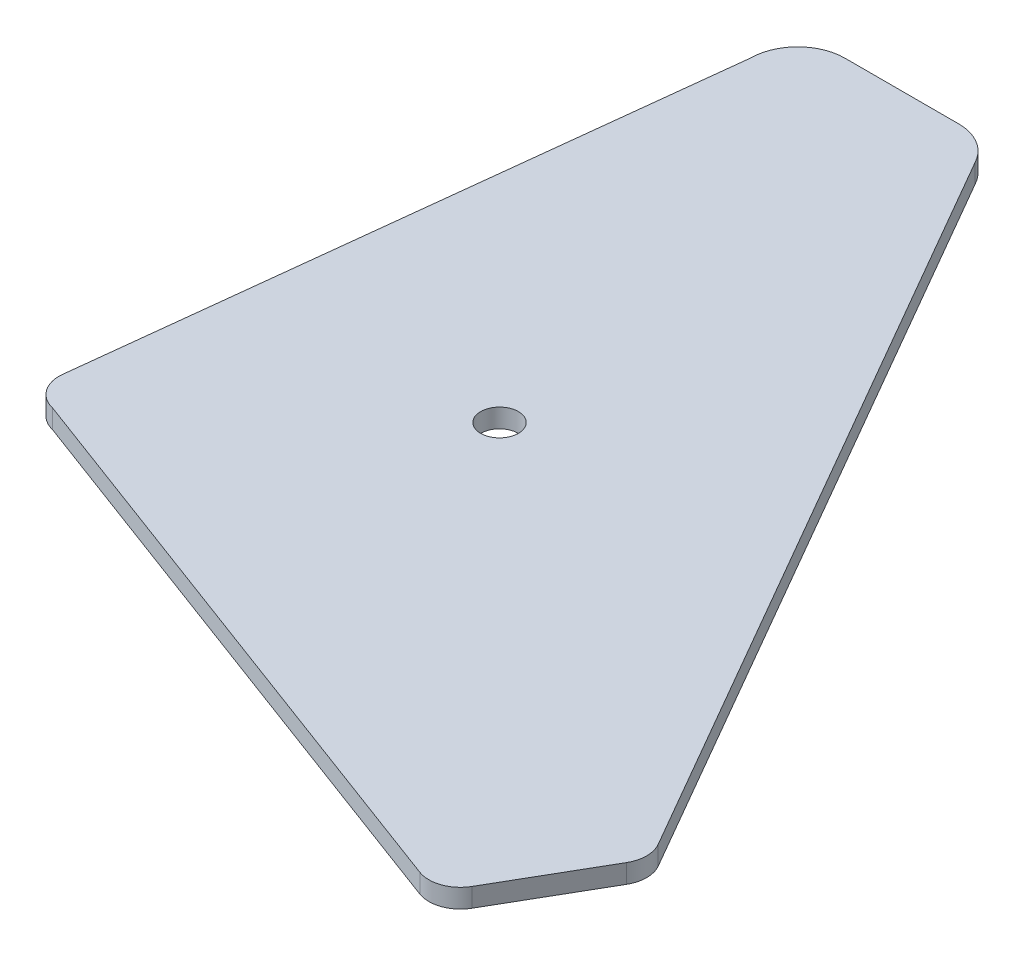
ISO-10303-21;
HEADER;
FILE_DESCRIPTION(('STEP AP214'),'2;1');
FILE_NAME('part.step','',(''),(''),'','','');
FILE_SCHEMA(('AUTOMOTIVE_DESIGN { 1 0 10303 214 1 1 1 1 }'));
ENDSEC;
DATA;
#1=APPLICATION_CONTEXT('core data for automotive mechanical design processes');
#2=APPLICATION_PROTOCOL_DEFINITION('international standard','automotive_design',2000,#1);
#3=PRODUCT_CONTEXT('',#1,'mechanical');
#4=PRODUCT('Part','Part','',(#3));
#5=PRODUCT_RELATED_PRODUCT_CATEGORY('part','',(#4));
#6=PRODUCT_DEFINITION_FORMATION('','',#4);
#7=PRODUCT_DEFINITION_CONTEXT('part definition',#1,'design');
#8=PRODUCT_DEFINITION('design','',#6,#7);
#9=PRODUCT_DEFINITION_SHAPE('','',#8);
#10=(LENGTH_UNIT() NAMED_UNIT(*) SI_UNIT(.MILLI.,.METRE.));
#11=(NAMED_UNIT(*) PLANE_ANGLE_UNIT() SI_UNIT($,.RADIAN.));
#12=(NAMED_UNIT(*) SI_UNIT($,.STERADIAN.) SOLID_ANGLE_UNIT());
#13=UNCERTAINTY_MEASURE_WITH_UNIT(LENGTH_MEASURE(1.E-05),#10,'distance_accuracy_value','');
#14=(GEOMETRIC_REPRESENTATION_CONTEXT(3) GLOBAL_UNCERTAINTY_ASSIGNED_CONTEXT((#13)) GLOBAL_UNIT_ASSIGNED_CONTEXT((#10,
#11,#12)) REPRESENTATION_CONTEXT('',''));
#15=CARTESIAN_POINT('',(0.,0.,0.));
#16=DIRECTION('',(0.,0.,1.));
#17=DIRECTION('',(1.,0.,0.));
#18=AXIS2_PLACEMENT_3D('',#15,#16,#17);
#19=CARTESIAN_POINT('',(596.941268489022,-6.,-523.011960660028));
#20=DIRECTION('',(0.,-1.,0.));
#21=DIRECTION('',(0.,0.,-1.));
#22=AXIS2_PLACEMENT_3D('',#19,#20,#21);
#23=PLANE('',#22);
#24=CARTESIAN_POINT('',(596.941268489022,-6.,-523.011960660028));
#25=DIRECTION('',(0.,-1.,0.));
#26=DIRECTION('',(0.,0.,-1.));
#27=AXIS2_PLACEMENT_3D('',#24,#25,#26);
#28=CIRCLE('',#27,15.);
#29=CARTESIAN_POINT('',(581.941268489022,-6.,-523.011960660028));
#30=VERTEX_POINT('',#29);
#31=CARTESIAN_POINT('',(596.941268489022,-6.,-538.011960660028));
#32=VERTEX_POINT('',#31);
#33=EDGE_CURVE('E125',#30,#32,#28,.T.);
#34=ORIENTED_EDGE('',*,*,#33,.T.);
#35=DIRECTION('',(-0.999999946599628,0.,-0.000326803827680212));
#36=VECTOR('',#35,1.);
#37=CARTESIAN_POINT('',(633.540164760071,-6.,-537.999999999999));
#38=LINE('',#37,#36);
#39=CARTESIAN_POINT('',(633.540164760071,-6.,-537.999999999999));
#40=VERTEX_POINT('',#39);
#41=EDGE_CURVE('E231',#40,#32,#38,.T.);
#42=ORIENTED_EDGE('',*,*,#41,.F.);
#43=CARTESIAN_POINT('',(633.051965401598,-6.,-523.007946725468));
#44=DIRECTION('',(0.,1.,0.));
#45=DIRECTION('',(0.,0.,1.));
#46=AXIS2_PLACEMENT_3D('',#43,#44,#45);
#47=CIRCLE('',#46,15.0000000000004);
#48=CARTESIAN_POINT('',(646.316882655115,-6.,-530.010943959323));
#49=VERTEX_POINT('',#48);
#50=EDGE_CURVE('E216',#49,#40,#47,.T.);
#51=ORIENTED_EDGE('',*,*,#50,.F.);
#52=DIRECTION('',(-0.499716952882985,0.,-0.866188759452202));
#53=VECTOR('',#52,1.);
#54=CARTESIAN_POINT('',(783.577542100858,-6.,-292.088977051909));
#55=LINE('',#54,#53);
#56=CARTESIAN_POINT('',(783.577542100858,-6.,-292.088977051909));
#57=VERTEX_POINT('',#56);
#58=EDGE_CURVE('E230',#57,#49,#55,.T.);
#59=ORIENTED_EDGE('',*,*,#58,.F.);
#60=CARTESIAN_POINT('',(774.915654506336,-6.,-287.091807523079));
#61=DIRECTION('',(0.,-1.,0.));
#62=DIRECTION('',(0.,0.,-1.));
#63=AXIS2_PLACEMENT_3D('',#60,#61,#62);
#64=CIRCLE('',#63,9.99999999999997);
#65=CARTESIAN_POINT('',(783.574274062581,-6.,-282.088977585913));
#66=VERTEX_POINT('',#65);
#67=EDGE_CURVE('E233',#57,#66,#64,.T.);
#68=ORIENTED_EDGE('',*,*,#67,.T.);
#69=DIRECTION('',(0.500282993716643,0.,-0.865861955624517));
#70=VECTOR('',#69,1.);
#71=CARTESIAN_POINT('',(765.564086288782,-6.,-250.91794718343));
#72=LINE('',#71,#70);
#73=CARTESIAN_POINT('',(765.564086288782,-6.,-250.91794718343));
#74=VERTEX_POINT('',#73);
#75=EDGE_CURVE('E239',#74,#66,#72,.T.);
#76=ORIENTED_EDGE('',*,*,#75,.F.);
#77=CARTESIAN_POINT('',(756.905466732537,-6.,-255.920777120597));
#78=DIRECTION('',(0.,-1.,0.));
#79=DIRECTION('',(0.,0.,-1.));
#80=AXIS2_PLACEMENT_3D('',#77,#78,#79);
#81=CIRCLE('',#80,9.99999999999988);
#82=CARTESIAN_POINT('',(753.410404170085,-6.,-246.551436819138));
#83=VERTEX_POINT('',#82);
#84=EDGE_CURVE('E154',#74,#83,#81,.T.);
#85=ORIENTED_EDGE('',*,*,#84,.T.);
#86=DIRECTION('',(-0.936934030145917,0.,-0.349506256245191));
#87=VECTOR('',#86,1.);
#88=CARTESIAN_POINT('',(753.410404170085,-6.,-246.551436819138));
#89=LINE('',#88,#87);
#90=CARTESIAN_POINT('',(567.332363615802,-6.,-315.964476831613));
#91=VERTEX_POINT('',#90);
#92=EDGE_CURVE('E147',#83,#91,#89,.T.);
#93=ORIENTED_EDGE('',*,*,#92,.T.);
#94=CARTESIAN_POINT('',(569.645526750389,-6.,-325.693262794557));
#95=DIRECTION('',(0.,1.,0.));
#96=DIRECTION('',(0.,0.,1.));
#97=AXIS2_PLACEMENT_3D('',#94,#95,#96);
#98=CIRCLE('',#97,9.99999999999998);
#99=CARTESIAN_POINT('',(559.709119695535,-6.,-326.819235636259));
#100=VERTEX_POINT('',#99);
#101=EDGE_CURVE('E151',#100,#91,#98,.T.);
#102=ORIENTED_EDGE('',*,*,#101,.F.);
#103=DIRECTION('',(-0.112597284170146,0.,0.993640705485392));
#104=VECTOR('',#103,1.);
#105=CARTESIAN_POINT('',(581.941268489022,-6.,-523.011960660028));
#106=LINE('',#105,#104);
#107=EDGE_CURVE('E169',#30,#100,#106,.T.);
#108=ORIENTED_EDGE('',*,*,#107,.F.);
#109=EDGE_LOOP('',(#34,#42,#51,#59,#68,#76,#85,#93,#102,#108));
#110=FACE_BOUND('',#109,.T.);
#111=CARTESIAN_POINT('',(642.330973066397,-6.,-382.939920306047));
#112=DIRECTION('',(0.,-1.,0.));
#113=DIRECTION('',(0.,0.,-1.));
#114=AXIS2_PLACEMENT_3D('',#111,#112,#113);
#115=CIRCLE('',#114,5.99999999999999);
#116=CARTESIAN_POINT('',(642.330973066397,-6.,-388.939920306047));
#117=VERTEX_POINT('',#116);
#118=EDGE_CURVE('E177',#117,#117,#115,.T.);
#119=ORIENTED_EDGE('',*,*,#118,.F.);
#120=EDGE_LOOP('',(#119));
#121=FACE_BOUND('',#120,.T.);
#122=ADVANCED_FACE('F65',(#110,#121),#23,.T.);
#123=CARTESIAN_POINT('',(596.941268489022,0.,-523.011960660028));
#124=DIRECTION('',(0.,-1.,0.));
#125=DIRECTION('',(0.,0.,-1.));
#126=AXIS2_PLACEMENT_3D('',#123,#124,#125);
#127=PLANE('',#126);
#128=CARTESIAN_POINT('',(596.941268489022,0.,-523.011960660028));
#129=DIRECTION('',(0.,-1.,0.));
#130=DIRECTION('',(0.,0.,-1.));
#131=AXIS2_PLACEMENT_3D('',#128,#129,#130);
#132=CIRCLE('',#131,15.);
#133=CARTESIAN_POINT('',(581.941268489022,0.,-523.011960660028));
#134=VERTEX_POINT('',#133);
#135=CARTESIAN_POINT('',(596.941268489022,0.,-538.011960660028));
#136=VERTEX_POINT('',#135);
#137=EDGE_CURVE('E174',#134,#136,#132,.T.);
#138=ORIENTED_EDGE('',*,*,#137,.F.);
#139=DIRECTION('',(-0.112597284170146,0.,0.993640705485392));
#140=VECTOR('',#139,1.);
#141=CARTESIAN_POINT('',(581.941268489022,0.,-523.011960660028));
#142=LINE('',#141,#140);
#143=CARTESIAN_POINT('',(559.709119695535,0.,-326.819235636259));
#144=VERTEX_POINT('',#143);
#145=EDGE_CURVE('E197',#134,#144,#142,.T.);
#146=ORIENTED_EDGE('',*,*,#145,.T.);
#147=CARTESIAN_POINT('',(569.645526750389,0.,-325.693262794557));
#148=DIRECTION('',(0.,1.,0.));
#149=DIRECTION('',(0.,0.,1.));
#150=AXIS2_PLACEMENT_3D('',#147,#148,#149);
#151=CIRCLE('',#150,9.99999999999998);
#152=CARTESIAN_POINT('',(567.332363615802,0.,-315.964476831613));
#153=VERTEX_POINT('',#152);
#154=EDGE_CURVE('E195',#144,#153,#151,.T.);
#155=ORIENTED_EDGE('',*,*,#154,.T.);
#156=DIRECTION('',(-0.936934030145917,0.,-0.349506256245191));
#157=VECTOR('',#156,1.);
#158=CARTESIAN_POINT('',(753.410404170085,0.,-246.551436819138));
#159=LINE('',#158,#157);
#160=CARTESIAN_POINT('',(753.410404170085,0.,-246.551436819138));
#161=VERTEX_POINT('',#160);
#162=EDGE_CURVE('E163',#161,#153,#159,.T.);
#163=ORIENTED_EDGE('',*,*,#162,.F.);
#164=CARTESIAN_POINT('',(756.905466732537,0.,-255.920777120597));
#165=DIRECTION('',(0.,-1.,0.));
#166=DIRECTION('',(0.,0.,-1.));
#167=AXIS2_PLACEMENT_3D('',#164,#165,#166);
#168=CIRCLE('',#167,9.99999999999988);
#169=CARTESIAN_POINT('',(765.564086288782,0.,-250.91794718343));
#170=VERTEX_POINT('',#169);
#171=EDGE_CURVE('E192',#170,#161,#168,.T.);
#172=ORIENTED_EDGE('',*,*,#171,.F.);
#173=DIRECTION('',(0.500282993716643,0.,-0.865861955624517));
#174=VECTOR('',#173,1.);
#175=CARTESIAN_POINT('',(765.564086288782,0.,-250.91794718343));
#176=LINE('',#175,#174);
#177=CARTESIAN_POINT('',(783.574274062581,0.,-282.088977585913));
#178=VERTEX_POINT('',#177);
#179=EDGE_CURVE('E189',#170,#178,#176,.T.);
#180=ORIENTED_EDGE('',*,*,#179,.T.);
#181=CARTESIAN_POINT('',(774.915654506336,0.,-287.091807523079));
#182=DIRECTION('',(0.,-1.,0.));
#183=DIRECTION('',(0.,0.,-1.));
#184=AXIS2_PLACEMENT_3D('',#181,#182,#183);
#185=CIRCLE('',#184,9.99999999999997);
#186=CARTESIAN_POINT('',(783.577542100858,0.,-292.088977051909));
#187=VERTEX_POINT('',#186);
#188=EDGE_CURVE('E186',#187,#178,#185,.T.);
#189=ORIENTED_EDGE('',*,*,#188,.F.);
#190=DIRECTION('',(-0.499716952882985,0.,-0.866188759452202));
#191=VECTOR('',#190,1.);
#192=CARTESIAN_POINT('',(783.577542100858,0.,-292.088977051909));
#193=LINE('',#192,#191);
#194=CARTESIAN_POINT('',(646.316882655115,0.,-530.010943959323));
#195=VERTEX_POINT('',#194);
#196=EDGE_CURVE('E183',#187,#195,#193,.T.);
#197=ORIENTED_EDGE('',*,*,#196,.T.);
#198=CARTESIAN_POINT('',(633.051965401598,0.,-523.007946725468));
#199=DIRECTION('',(0.,1.,0.));
#200=DIRECTION('',(0.,0.,1.));
#201=AXIS2_PLACEMENT_3D('',#198,#199,#200);
#202=CIRCLE('',#201,15.0000000000004);
#203=CARTESIAN_POINT('',(633.540164760071,0.,-537.999999999999));
#204=VERTEX_POINT('',#203);
#205=EDGE_CURVE('E180',#195,#204,#202,.T.);
#206=ORIENTED_EDGE('',*,*,#205,.T.);
#207=DIRECTION('',(-0.999999946599628,0.,-0.000326803827680212));
#208=VECTOR('',#207,1.);
#209=CARTESIAN_POINT('',(633.540164760071,0.,-537.999999999999));
#210=LINE('',#209,#208);
#211=EDGE_CURVE('E176',#204,#136,#210,.T.);
#212=ORIENTED_EDGE('',*,*,#211,.T.);
#213=EDGE_LOOP('',(#138,#146,#155,#163,#172,#180,#189,#197,#206,#212));
#214=FACE_BOUND('',#213,.T.);
#215=CARTESIAN_POINT('',(642.330973066397,0.,-382.939920306047));
#216=DIRECTION('',(0.,-1.,0.));
#217=DIRECTION('',(0.,0.,-1.));
#218=AXIS2_PLACEMENT_3D('',#215,#216,#217);
#219=CIRCLE('',#218,5.99999999999999);
#220=CARTESIAN_POINT('',(642.330973066397,0.,-388.939920306047));
#221=VERTEX_POINT('',#220);
#222=EDGE_CURVE('E356',#221,#221,#219,.T.);
#223=ORIENTED_EDGE('',*,*,#222,.T.);
#224=EDGE_LOOP('',(#223));
#225=FACE_BOUND('',#224,.T.);
#226=ADVANCED_FACE('F221',(#214,#225),#127,.F.);
#227=CARTESIAN_POINT('',(596.941268489022,-6.,-523.011960660028));
#228=DIRECTION('',(0.,1.,0.));
#229=DIRECTION('',(0.,0.,1.));
#230=AXIS2_PLACEMENT_3D('',#227,#228,#229);
#231=CYLINDRICAL_SURFACE('',#230,15.);
#232=ORIENTED_EDGE('',*,*,#137,.T.);
#233=DIRECTION('',(0.,1.,0.));
#234=VECTOR('',#233,1.);
#235=CARTESIAN_POINT('',(596.941268489022,-6.,-538.011960660028));
#236=LINE('',#235,#234);
#237=EDGE_CURVE('E12',#32,#136,#236,.T.);
#238=ORIENTED_EDGE('',*,*,#237,.F.);
#239=ORIENTED_EDGE('',*,*,#33,.F.);
#240=DIRECTION('',(0.,1.,0.));
#241=VECTOR('',#240,1.);
#242=CARTESIAN_POINT('',(581.941268489022,-6.,-523.011960660028));
#243=LINE('',#242,#241);
#244=EDGE_CURVE('E82',#30,#134,#243,.T.);
#245=ORIENTED_EDGE('',*,*,#244,.T.);
#246=EDGE_LOOP('',(#232,#238,#239,#245));
#247=FACE_BOUND('',#246,.T.);
#248=ADVANCED_FACE('F67',(#247),#231,.T.);
#249=CARTESIAN_POINT('',(633.540164760071,-6.,-537.999999999999));
#250=DIRECTION('',(0.000326803827680212,0.,-0.999999946599628));
#251=DIRECTION('',(-0.999999946599628,0.,-0.000326803827680212));
#252=AXIS2_PLACEMENT_3D('',#249,#250,#251);
#253=PLANE('',#252);
#254=ORIENTED_EDGE('',*,*,#211,.F.);
#255=DIRECTION('',(0.,1.,0.));
#256=VECTOR('',#255,1.);
#257=CARTESIAN_POINT('',(633.540164760071,-6.,-537.999999999999));
#258=LINE('',#257,#256);
#259=EDGE_CURVE('E74',#40,#204,#258,.T.);
#260=ORIENTED_EDGE('',*,*,#259,.F.);
#261=ORIENTED_EDGE('',*,*,#41,.T.);
#262=ORIENTED_EDGE('',*,*,#237,.T.);
#263=EDGE_LOOP('',(#254,#260,#261,#262));
#264=FACE_BOUND('',#263,.T.);
#265=ADVANCED_FACE('F219',(#264),#253,.T.);
#266=CARTESIAN_POINT('',(633.051965401598,-6.,-523.007946725468));
#267=DIRECTION('',(0.,1.,0.));
#268=DIRECTION('',(0.,0.,1.));
#269=AXIS2_PLACEMENT_3D('',#266,#267,#268);
#270=CYLINDRICAL_SURFACE('',#269,15.0000000000004);
#271=ORIENTED_EDGE('',*,*,#205,.F.);
#272=DIRECTION('',(0.,1.,0.));
#273=VECTOR('',#272,1.);
#274=CARTESIAN_POINT('',(646.316882655115,-6.,-530.010943959323));
#275=LINE('',#274,#273);
#276=EDGE_CURVE('E209',#49,#195,#275,.T.);
#277=ORIENTED_EDGE('',*,*,#276,.F.);
#278=ORIENTED_EDGE('',*,*,#50,.T.);
#279=ORIENTED_EDGE('',*,*,#259,.T.);
#280=EDGE_LOOP('',(#271,#277,#278,#279));
#281=FACE_BOUND('',#280,.T.);
#282=ADVANCED_FACE('F214',(#281),#270,.T.);
#283=CARTESIAN_POINT('',(783.577542100858,-6.,-292.088977051909));
#284=DIRECTION('',(0.866188759452202,0.,-0.499716952882985));
#285=DIRECTION('',(-0.499716952882985,0.,-0.866188759452202));
#286=AXIS2_PLACEMENT_3D('',#283,#284,#285);
#287=PLANE('',#286);
#288=ORIENTED_EDGE('',*,*,#196,.F.);
#289=DIRECTION('',(0.,1.,0.));
#290=VECTOR('',#289,1.);
#291=CARTESIAN_POINT('',(783.577542100858,-6.,-292.088977051909));
#292=LINE('',#291,#290);
#293=EDGE_CURVE('E207',#57,#187,#292,.T.);
#294=ORIENTED_EDGE('',*,*,#293,.F.);
#295=ORIENTED_EDGE('',*,*,#58,.T.);
#296=ORIENTED_EDGE('',*,*,#276,.T.);
#297=EDGE_LOOP('',(#288,#294,#295,#296));
#298=FACE_BOUND('',#297,.T.);
#299=ADVANCED_FACE('F226',(#298),#287,.T.);
#300=CARTESIAN_POINT('',(774.915654506336,-6.,-287.091807523079));
#301=DIRECTION('',(0.,1.,0.));
#302=DIRECTION('',(0.,0.,1.));
#303=AXIS2_PLACEMENT_3D('',#300,#301,#302);
#304=CYLINDRICAL_SURFACE('',#303,9.99999999999997);
#305=ORIENTED_EDGE('',*,*,#188,.T.);
#306=DIRECTION('',(0.,1.,0.));
#307=VECTOR('',#306,1.);
#308=CARTESIAN_POINT('',(783.574274062581,-6.,-282.088977585913));
#309=LINE('',#308,#307);
#310=EDGE_CURVE('E205',#66,#178,#309,.T.);
#311=ORIENTED_EDGE('',*,*,#310,.F.);
#312=ORIENTED_EDGE('',*,*,#67,.F.);
#313=ORIENTED_EDGE('',*,*,#293,.T.);
#314=EDGE_LOOP('',(#305,#311,#312,#313));
#315=FACE_BOUND('',#314,.T.);
#316=ADVANCED_FACE('F246',(#315),#304,.T.);
#317=CARTESIAN_POINT('',(765.564086288782,-6.,-250.91794718343));
#318=DIRECTION('',(0.865861955624517,0.,0.500282993716643));
#319=DIRECTION('',(0.500282993716643,0.,-0.865861955624517));
#320=AXIS2_PLACEMENT_3D('',#317,#318,#319);
#321=PLANE('',#320);
#322=ORIENTED_EDGE('',*,*,#179,.F.);
#323=DIRECTION('',(0.,1.,0.));
#324=VECTOR('',#323,1.);
#325=CARTESIAN_POINT('',(765.564086288782,-6.,-250.91794718343));
#326=LINE('',#325,#324);
#327=EDGE_CURVE('E203',#74,#170,#326,.T.);
#328=ORIENTED_EDGE('',*,*,#327,.F.);
#329=ORIENTED_EDGE('',*,*,#75,.T.);
#330=ORIENTED_EDGE('',*,*,#310,.T.);
#331=EDGE_LOOP('',(#322,#328,#329,#330));
#332=FACE_BOUND('',#331,.T.);
#333=ADVANCED_FACE('F243',(#332),#321,.T.);
#334=CARTESIAN_POINT('',(756.905466732537,-6.,-255.920777120597));
#335=DIRECTION('',(0.,1.,0.));
#336=DIRECTION('',(0.,0.,1.));
#337=AXIS2_PLACEMENT_3D('',#334,#335,#336);
#338=CYLINDRICAL_SURFACE('',#337,9.99999999999988);
#339=ORIENTED_EDGE('',*,*,#171,.T.);
#340=DIRECTION('',(0.,1.,0.));
#341=VECTOR('',#340,1.);
#342=CARTESIAN_POINT('',(753.410404170085,-6.,-246.551436819138));
#343=LINE('',#342,#341);
#344=EDGE_CURVE('E166',#83,#161,#343,.T.);
#345=ORIENTED_EDGE('',*,*,#344,.F.);
#346=ORIENTED_EDGE('',*,*,#84,.F.);
#347=ORIENTED_EDGE('',*,*,#327,.T.);
#348=EDGE_LOOP('',(#339,#345,#346,#347));
#349=FACE_BOUND('',#348,.T.);
#350=ADVANCED_FACE('F249',(#349),#338,.T.);
#351=CARTESIAN_POINT('',(753.410404170085,-6.,-246.551436819138));
#352=DIRECTION('',(0.349506256245191,0.,-0.936934030145918));
#353=DIRECTION('',(-0.936934030145918,0.,-0.349506256245191));
#354=AXIS2_PLACEMENT_3D('',#351,#352,#353);
#355=PLANE('',#354);
#356=ORIENTED_EDGE('',*,*,#162,.T.);
#357=DIRECTION('',(0.,1.,0.));
#358=VECTOR('',#357,1.);
#359=CARTESIAN_POINT('',(567.332363615802,-6.,-315.964476831613));
#360=LINE('',#359,#358);
#361=EDGE_CURVE('E160',#91,#153,#360,.T.);
#362=ORIENTED_EDGE('',*,*,#361,.F.);
#363=ORIENTED_EDGE('',*,*,#92,.F.);
#364=ORIENTED_EDGE('',*,*,#344,.T.);
#365=EDGE_LOOP('',(#356,#362,#363,#364));
#366=FACE_BOUND('',#365,.T.);
#367=ADVANCED_FACE('F161',(#366),#355,.F.);
#368=CARTESIAN_POINT('',(569.645526750389,-6.,-325.693262794557));
#369=DIRECTION('',(0.,1.,0.));
#370=DIRECTION('',(0.,0.,1.));
#371=AXIS2_PLACEMENT_3D('',#368,#369,#370);
#372=CYLINDRICAL_SURFACE('',#371,9.99999999999998);
#373=ORIENTED_EDGE('',*,*,#154,.F.);
#374=DIRECTION('',(0.,1.,0.));
#375=VECTOR('',#374,1.);
#376=CARTESIAN_POINT('',(559.709119695535,-6.,-326.819235636259));
#377=LINE('',#376,#375);
#378=EDGE_CURVE('E113',#100,#144,#377,.T.);
#379=ORIENTED_EDGE('',*,*,#378,.F.);
#380=ORIENTED_EDGE('',*,*,#101,.T.);
#381=ORIENTED_EDGE('',*,*,#361,.T.);
#382=EDGE_LOOP('',(#373,#379,#380,#381));
#383=FACE_BOUND('',#382,.T.);
#384=ADVANCED_FACE('F168',(#383),#372,.T.);
#385=CARTESIAN_POINT('',(581.941268489022,-6.,-523.011960660028));
#386=DIRECTION('',(-0.993640705485392,0.,-0.112597284170146));
#387=DIRECTION('',(-0.112597284170146,0.,0.993640705485392));
#388=AXIS2_PLACEMENT_3D('',#385,#386,#387);
#389=PLANE('',#388);
#390=ORIENTED_EDGE('',*,*,#145,.F.);
#391=ORIENTED_EDGE('',*,*,#244,.F.);
#392=ORIENTED_EDGE('',*,*,#107,.T.);
#393=ORIENTED_EDGE('',*,*,#378,.T.);
#394=EDGE_LOOP('',(#390,#391,#392,#393));
#395=FACE_BOUND('',#394,.T.);
#396=ADVANCED_FACE('F267',(#395),#389,.T.);
#397=CARTESIAN_POINT('',(642.330973066397,-6.,-382.939920306047));
#398=DIRECTION('',(0.,1.,0.));
#399=DIRECTION('',(0.,0.,1.));
#400=AXIS2_PLACEMENT_3D('',#397,#398,#399);
#401=CYLINDRICAL_SURFACE('',#400,5.99999999999999);
#402=ORIENTED_EDGE('',*,*,#118,.T.);
#403=EDGE_LOOP('',(#402));
#404=FACE_BOUND('',#403,.T.);
#405=ORIENTED_EDGE('',*,*,#222,.F.);
#406=EDGE_LOOP('',(#405));
#407=FACE_BOUND('',#406,.T.);
#408=ADVANCED_FACE('F265',(#404,#407),#401,.F.);
#409=CLOSED_SHELL('',(#122,#226,#248,#265,#282,#299,#316,#333,#350,#367,#384,#396,#408));
#410=MANIFOLD_SOLID_BREP('B2',#409);
#411=ADVANCED_BREP_SHAPE_REPRESENTATION('',(#18,#410),#14);
#412=SHAPE_DEFINITION_REPRESENTATION(#9,#411);
ENDSEC;
END-ISO-10303-21;
